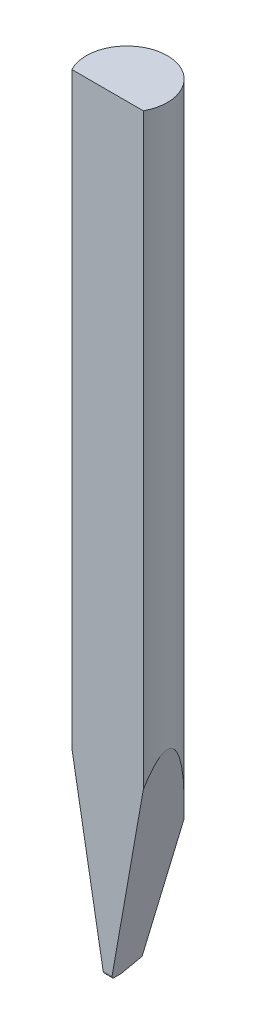
ISO-10303-21;
HEADER;
FILE_DESCRIPTION(('STEP AP214'),'2;1');
FILE_NAME('part.step','',(''),(''),'','','');
FILE_SCHEMA(('AUTOMOTIVE_DESIGN { 1 0 10303 214 1 1 1 1 }'));
ENDSEC;
DATA;
#1=APPLICATION_CONTEXT('core data for automotive mechanical design processes');
#2=APPLICATION_PROTOCOL_DEFINITION('international standard','automotive_design',2000,#1);
#3=PRODUCT_CONTEXT('',#1,'mechanical');
#4=PRODUCT('Part','Part','',(#3));
#5=PRODUCT_RELATED_PRODUCT_CATEGORY('part','',(#4));
#6=PRODUCT_DEFINITION_FORMATION('','',#4);
#7=PRODUCT_DEFINITION_CONTEXT('part definition',#1,'design');
#8=PRODUCT_DEFINITION('design','',#6,#7);
#9=PRODUCT_DEFINITION_SHAPE('','',#8);
#10=(LENGTH_UNIT() NAMED_UNIT(*) SI_UNIT(.MILLI.,.METRE.));
#11=(NAMED_UNIT(*) PLANE_ANGLE_UNIT() SI_UNIT($,.RADIAN.));
#12=(NAMED_UNIT(*) SI_UNIT($,.STERADIAN.) SOLID_ANGLE_UNIT());
#13=UNCERTAINTY_MEASURE_WITH_UNIT(LENGTH_MEASURE(1.E-05),#10,'distance_accuracy_value','');
#14=(GEOMETRIC_REPRESENTATION_CONTEXT(3) GLOBAL_UNCERTAINTY_ASSIGNED_CONTEXT((#13)) GLOBAL_UNIT_ASSIGNED_CONTEXT((#10,
#11,#12)) REPRESENTATION_CONTEXT('',''));
#15=CARTESIAN_POINT('',(0.,0.,0.));
#16=DIRECTION('',(0.,0.,1.));
#17=DIRECTION('',(1.,0.,0.));
#18=AXIS2_PLACEMENT_3D('',#15,#16,#17);
#19=CARTESIAN_POINT('',(0.,0.,0.));
#20=DIRECTION('',(0.,1.,0.));
#21=DIRECTION('',(0.,0.,1.));
#22=AXIS2_PLACEMENT_3D('',#19,#20,#21);
#23=PLANE('',#22);
#24=DIRECTION('',(0.,0.,-1.));
#25=VECTOR('',#24,1.);
#26=CARTESIAN_POINT('',(-0.0475000000000001,0.,0.10865));
#27=LINE('',#26,#25);
#28=CARTESIAN_POINT('',(-0.0475,0.,0.257439310229206));
#29=VERTEX_POINT('',#28);
#30=CARTESIAN_POINT('',(-0.0475,0.,0.1875));
#31=VERTEX_POINT('',#30);
#32=EDGE_CURVE('E312',#29,#31,#27,.T.);
#33=ORIENTED_EDGE('',*,*,#32,.F.);
#34=DIRECTION('',(-1.,0.,0.));
#35=VECTOR('',#34,1.);
#36=CARTESIAN_POINT('',(0.,0.,0.257439310229206));
#37=LINE('',#36,#35);
#38=CARTESIAN_POINT('',(-0.0255,0.,0.257439310229206));
#39=VERTEX_POINT('',#38);
#40=EDGE_CURVE('E298',#29,#39,#37,.F.);
#41=ORIENTED_EDGE('',*,*,#40,.T.);
#42=DIRECTION('',(0.,0.,-1.));
#43=VECTOR('',#42,1.);
#44=CARTESIAN_POINT('',(-0.0255,0.,-0.7935));
#45=LINE('',#44,#43);
#46=CARTESIAN_POINT('',(-0.0255,0.,0.3245));
#47=VERTEX_POINT('',#46);
#48=EDGE_CURVE('E232',#47,#39,#45,.T.);
#49=ORIENTED_EDGE('',*,*,#48,.F.);
#50=DIRECTION('',(-1.,0.,0.));
#51=VECTOR('',#50,1.);
#52=CARTESIAN_POINT('',(0.8025,0.,0.3245));
#53=LINE('',#52,#51);
#54=CARTESIAN_POINT('',(-0.0775,0.,0.3245));
#55=VERTEX_POINT('',#54);
#56=EDGE_CURVE('E394',#47,#55,#53,.T.);
#57=ORIENTED_EDGE('',*,*,#56,.T.);
#58=DIRECTION('',(0.,0.,-1.));
#59=VECTOR('',#58,1.);
#60=CARTESIAN_POINT('',(-0.0775,0.,0.8025));
#61=LINE('',#60,#59);
#62=CARTESIAN_POINT('',(-0.0775,0.,0.1875));
#63=VERTEX_POINT('',#62);
#64=EDGE_CURVE('E366',#55,#63,#61,.T.);
#65=ORIENTED_EDGE('',*,*,#64,.T.);
#66=DIRECTION('',(-1.,0.,0.));
#67=VECTOR('',#66,1.);
#68=CARTESIAN_POINT('',(0.8025,0.,0.1875));
#69=LINE('',#68,#67);
#70=EDGE_CURVE('E385',#31,#63,#69,.T.);
#71=ORIENTED_EDGE('',*,*,#70,.F.);
#72=EDGE_LOOP('',(#33,#41,#49,#57,#65,#71));
#73=FACE_BOUND('',#72,.T.);
#74=ADVANCED_FACE('F91',(#73),#23,.F.);
#75=DIRECTION('',(0.,0.,1.));
#76=VECTOR('',#75,1.);
#77=CARTESIAN_POINT('',(0.0255000000000001,0.,-0.7935));
#78=LINE('',#77,#76);
#79=CARTESIAN_POINT('',(0.0255000000000001,0.,0.257439310229206));
#80=VERTEX_POINT('',#79);
#81=CARTESIAN_POINT('',(0.0255000000000001,0.,0.3245));
#82=VERTEX_POINT('',#81);
#83=EDGE_CURVE('E237',#80,#82,#78,.T.);
#84=ORIENTED_EDGE('',*,*,#83,.F.);
#85=DIRECTION('',(-1.,0.,0.));
#86=VECTOR('',#85,1.);
#87=CARTESIAN_POINT('',(0.,0.,0.257439310229206));
#88=LINE('',#87,#86);
#89=CARTESIAN_POINT('',(0.0475,0.,0.257439310229206));
#90=VERTEX_POINT('',#89);
#91=EDGE_CURVE('E303',#80,#90,#88,.F.);
#92=ORIENTED_EDGE('',*,*,#91,.T.);
#93=DIRECTION('',(0.,0.,1.));
#94=VECTOR('',#93,1.);
#95=CARTESIAN_POINT('',(0.0475,0.,0.10865));
#96=LINE('',#95,#94);
#97=CARTESIAN_POINT('',(0.0475,0.,0.1875));
#98=VERTEX_POINT('',#97);
#99=EDGE_CURVE('E105',#98,#90,#96,.T.);
#100=ORIENTED_EDGE('',*,*,#99,.F.);
#101=CARTESIAN_POINT('',(0.0775000000000001,0.,0.1875));
#102=VERTEX_POINT('',#101);
#103=EDGE_CURVE('E382',#102,#98,#69,.T.);
#104=ORIENTED_EDGE('',*,*,#103,.F.);
#105=DIRECTION('',(0.,0.,-1.));
#106=VECTOR('',#105,1.);
#107=CARTESIAN_POINT('',(0.0775,0.,0.8025));
#108=LINE('',#107,#106);
#109=CARTESIAN_POINT('',(0.0774999999999998,0.,0.3245));
#110=VERTEX_POINT('',#109);
#111=EDGE_CURVE('E369',#110,#102,#108,.T.);
#112=ORIENTED_EDGE('',*,*,#111,.F.);
#113=EDGE_CURVE('E392',#110,#82,#53,.T.);
#114=ORIENTED_EDGE('',*,*,#113,.T.);
#115=EDGE_LOOP('',(#84,#92,#100,#104,#112,#114));
#116=FACE_BOUND('',#115,.T.);
#117=ADVANCED_FACE('F272',(#116),#23,.F.);
#118=CARTESIAN_POINT('',(0.8025,4.1116793192229,0.8025));
#119=DIRECTION('',(0.984807753012208,-0.173648177666928,0.));
#120=DIRECTION('',(0.173648177666928,0.984807753012209,0.));
#121=AXIS2_PLACEMENT_3D('',#118,#119,#120);
#122=PLANE('',#121);
#123=DIRECTION('',(0.173648177666928,0.984807753012209,0.));
#124=VECTOR('',#123,1.);
#125=CARTESIAN_POINT('',(2.61611582808828,14.397205792831,0.3755));
#126=LINE('',#125,#124);
#127=CARTESIAN_POINT('',(0.0864926760161312,0.0510000000000007,0.3755));
#128=VERTEX_POINT('',#127);
#129=CARTESIAN_POINT('',(0.697893974755478,3.51842907003117,0.3755));
#130=VERTEX_POINT('',#129);
#131=EDGE_CURVE('E348',#128,#130,#126,.T.);
#132=ORIENTED_EDGE('',*,*,#131,.F.);
#133=CARTESIAN_POINT('',(0.0864926760161314,0.051,0.3245));
#134=DIRECTION('',(0.984807753012208,-0.173648177666928,0.));
#135=DIRECTION('',(-0.173648177666928,-0.984807753012209,0.));
#136=AXIS2_PLACEMENT_3D('',#133,#134,#135);
#137=ELLIPSE('',#136,0.051786757206173,0.051);
#138=EDGE_CURVE('E386',#128,#110,#137,.T.);
#139=ORIENTED_EDGE('',*,*,#138,.T.);
#140=ORIENTED_EDGE('',*,*,#111,.T.);
#141=DIRECTION('',(0.0455893306574906,0.258549942126371,-0.964921520309633));
#142=VECTOR('',#141,1.);
#143=CARTESIAN_POINT('',(0.100417755598953,0.129973050674789,-0.29756602873305));
#144=LINE('',#143,#142);
#145=CARTESIAN_POINT('',(0.0958977476958887,0.104338812029609,-0.201897747695888));
#146=VERTEX_POINT('',#145);
#147=EDGE_CURVE('E376',#102,#146,#144,.T.);
#148=ORIENTED_EDGE('',*,*,#147,.T.);
#149=DIRECTION('',(0.171087869746033,0.970287525247816,-0.171087869746028));
#150=VECTOR('',#149,1.);
#151=CARTESIAN_POINT('',(0.752417217752885,3.82764574678896,-0.858417217752867));
#152=LINE('',#151,#150);
#153=CARTESIAN_POINT('',(0.504870168587644,2.4237366673581,-0.610870168587633));
#154=VERTEX_POINT('',#153);
#155=EDGE_CURVE('E371',#146,#154,#152,.T.);
#156=ORIENTED_EDGE('',*,*,#155,.T.);
#157=CARTESIAN_POINT('',(0.,-0.439524341020377,0.));
#158=DIRECTION('',(0.984807753012208,-0.173648177666928,0.));
#159=DIRECTION('',(-0.173648177666928,-0.984807753012209,0.));
#160=AXIS2_PLACEMENT_3D('',#157,#158,#159);
#161=ELLIPSE('',#160,4.5638256078914,0.7925);
#162=EDGE_CURVE('E363',#154,#130,#161,.T.);
#163=ORIENTED_EDGE('',*,*,#162,.T.);
#164=EDGE_LOOP('',(#132,#139,#140,#148,#156,#163));
#165=FACE_BOUND('',#164,.T.);
#166=ADVANCED_FACE('F278',(#165),#122,.T.);
#167=CARTESIAN_POINT('',(-0.0775,0.,0.8025));
#168=DIRECTION('',(-0.984807753012208,-0.173648177666928,0.));
#169=DIRECTION('',(0.173648177666928,-0.984807753012209,0.));
#170=AXIS2_PLACEMENT_3D('',#167,#168,#169);
#171=PLANE('',#170);
#172=ORIENTED_EDGE('',*,*,#64,.F.);
#173=CARTESIAN_POINT('',(-0.0864926760161316,0.051,0.3245));
#174=DIRECTION('',(-0.984807753012208,-0.173648177666928,0.));
#175=DIRECTION('',(-0.173648177666928,0.984807753012209,0.));
#176=AXIS2_PLACEMENT_3D('',#173,#174,#175);
#177=ELLIPSE('',#176,0.051786757206173,0.051);
#178=CARTESIAN_POINT('',(-0.0864926760161314,0.051,0.3755));
#179=VERTEX_POINT('',#178);
#180=EDGE_CURVE('E389',#55,#179,#177,.T.);
#181=ORIENTED_EDGE('',*,*,#180,.T.);
#182=DIRECTION('',(0.173648177666928,-0.984807753012209,0.));
#183=VECTOR('',#182,1.);
#184=CARTESIAN_POINT('',(-2.66451249990759,14.6716769578499,0.3755));
#185=LINE('',#184,#183);
#186=CARTESIAN_POINT('',(-0.697893974755478,3.51842907003117,0.3755));
#187=VERTEX_POINT('',#186);
#188=EDGE_CURVE('E345',#187,#179,#185,.T.);
#189=ORIENTED_EDGE('',*,*,#188,.F.);
#190=CARTESIAN_POINT('',(0.,-0.439524341020377,0.));
#191=DIRECTION('',(-0.984807753012208,-0.173648177666928,0.));
#192=DIRECTION('',(0.173648177666928,-0.984807753012209,0.));
#193=AXIS2_PLACEMENT_3D('',#190,#191,#192);
#194=ELLIPSE('',#193,4.5638256078914,0.7925);
#195=CARTESIAN_POINT('',(-0.504870168587645,2.4237366673581,-0.610870168587633));
#196=VERTEX_POINT('',#195);
#197=EDGE_CURVE('E360',#187,#196,#194,.T.);
#198=ORIENTED_EDGE('',*,*,#197,.T.);
#199=DIRECTION('',(0.171087869746033,-0.970287525247816,0.171087869746028));
#200=VECTOR('',#199,1.);
#201=CARTESIAN_POINT('',(-0.0486387356542045,-0.163680363775494,-0.154638735654206));
#202=LINE('',#201,#200);
#203=CARTESIAN_POINT('',(-0.0958977476958886,0.104338812029609,-0.201897747695889));
#204=VERTEX_POINT('',#203);
#205=EDGE_CURVE('E339',#196,#204,#202,.T.);
#206=ORIENTED_EDGE('',*,*,#205,.T.);
#207=DIRECTION('',(0.0455893306574906,-0.258549942126371,0.964921520309633));
#208=VECTOR('',#207,1.);
#209=CARTESIAN_POINT('',(-0.0504460723575265,-0.153430447988015,0.760110227319341));
#210=LINE('',#209,#208);
#211=EDGE_CURVE('E342',#204,#63,#210,.T.);
#212=ORIENTED_EDGE('',*,*,#211,.T.);
#213=EDGE_LOOP('',(#172,#181,#189,#198,#206,#212));
#214=FACE_BOUND('',#213,.T.);
#215=ADVANCED_FACE('F465',(#214),#171,.T.);
#216=CARTESIAN_POINT('',(-0.8025,15.,0.3755));
#217=DIRECTION('',(0.,0.,1.));
#218=DIRECTION('',(1.,0.,0.));
#219=AXIS2_PLACEMENT_3D('',#216,#217,#218);
#220=PLANE('',#219);
#221=ORIENTED_EDGE('',*,*,#188,.T.);
#222=DIRECTION('',(1.,0.,0.));
#223=VECTOR('',#222,1.);
#224=CARTESIAN_POINT('',(-0.8025,0.0510000000000007,0.3755));
#225=LINE('',#224,#223);
#226=EDGE_CURVE('E336',#179,#128,#225,.T.);
#227=ORIENTED_EDGE('',*,*,#226,.T.);
#228=ORIENTED_EDGE('',*,*,#131,.T.);
#229=DIRECTION('',(0.,-1.,0.));
#230=VECTOR('',#229,1.);
#231=CARTESIAN_POINT('',(0.697893974755478,15.,0.3755));
#232=LINE('',#231,#230);
#233=CARTESIAN_POINT('',(0.697893974755478,15.,0.3755));
#234=VERTEX_POINT('',#233);
#235=EDGE_CURVE('E356',#130,#234,#232,.F.);
#236=ORIENTED_EDGE('',*,*,#235,.T.);
#237=DIRECTION('',(-1.,0.,0.));
#238=VECTOR('',#237,1.);
#239=CARTESIAN_POINT('',(-0.8025,15.,0.3755));
#240=LINE('',#239,#238);
#241=CARTESIAN_POINT('',(-0.697893974755478,15.,0.3755));
#242=VERTEX_POINT('',#241);
#243=EDGE_CURVE('E358',#234,#242,#240,.T.);
#244=ORIENTED_EDGE('',*,*,#243,.T.);
#245=DIRECTION('',(0.,-1.,0.));
#246=VECTOR('',#245,1.);
#247=CARTESIAN_POINT('',(-0.697893974755478,15.,0.3755));
#248=LINE('',#247,#246);
#249=EDGE_CURVE('E353',#242,#187,#248,.T.);
#250=ORIENTED_EDGE('',*,*,#249,.T.);
#251=EDGE_LOOP('',(#221,#227,#228,#236,#244,#250));
#252=FACE_BOUND('',#251,.T.);
#253=ADVANCED_FACE('F286',(#252),#220,.T.);
#254=CARTESIAN_POINT('',(0.,15.,0.));
#255=DIRECTION('',(0.,-1.,0.));
#256=DIRECTION('',(0.,0.,-1.));
#257=AXIS2_PLACEMENT_3D('',#254,#255,#256);
#258=CYLINDRICAL_SURFACE('',#257,0.7925);
#259=CARTESIAN_POINT('',(0.,-1.0406802138999,0.));
#260=DIRECTION('',(0.,-0.173648177666923,-0.984807753012209));
#261=DIRECTION('',(0.,-0.984807753012209,0.173648177666923));
#262=AXIS2_PLACEMENT_3D('',#259,#260,#261);
#263=ELLIPSE('',#262,4.56382560789152,0.7925);
#264=EDGE_CURVE('E374',#196,#154,#263,.T.);
#265=ORIENTED_EDGE('',*,*,#264,.F.);
#266=ORIENTED_EDGE('',*,*,#197,.F.);
#267=ORIENTED_EDGE('',*,*,#249,.F.);
#268=CARTESIAN_POINT('',(0.,15.,0.));
#269=DIRECTION('',(0.,1.,0.));
#270=DIRECTION('',(0.,0.,1.));
#271=AXIS2_PLACEMENT_3D('',#268,#269,#270);
#272=CIRCLE('',#271,0.7925);
#273=EDGE_CURVE('E350',#234,#242,#272,.T.);
#274=ORIENTED_EDGE('',*,*,#273,.F.);
#275=ORIENTED_EDGE('',*,*,#235,.F.);
#276=ORIENTED_EDGE('',*,*,#162,.F.);
#277=EDGE_LOOP('',(#265,#266,#267,#274,#275,#276));
#278=FACE_BOUND('',#277,.T.);
#279=ADVANCED_FACE('F284',(#278),#258,.T.);
#280=CARTESIAN_POINT('',(0.,15.,0.));
#281=DIRECTION('',(0.,1.,0.));
#282=DIRECTION('',(0.,0.,1.));
#283=AXIS2_PLACEMENT_3D('',#280,#281,#282);
#284=PLANE('',#283);
#285=ORIENTED_EDGE('',*,*,#273,.T.);
#286=ORIENTED_EDGE('',*,*,#243,.F.);
#287=EDGE_LOOP('',(#285,#286));
#288=FACE_BOUND('',#287,.T.);
#289=ADVANCED_FACE('F282',(#288),#284,.T.);
#290=CARTESIAN_POINT('',(0.8025,0.104338812029609,-0.201897747695888));
#291=DIRECTION('',(0.,-0.173648177666923,-0.984807753012209));
#292=DIRECTION('',(0.,0.984807753012209,-0.173648177666923));
#293=AXIS2_PLACEMENT_3D('',#290,#291,#292);
#294=PLANE('',#293);
#295=CARTESIAN_POINT('',(0.,0.603593196235099,-0.289929765868303));
#296=DIRECTION('',(0.,-0.173648177666923,-0.984807753012209));
#297=DIRECTION('',(0.,0.984807753012209,-0.173648177666923));
#298=AXIS2_PLACEMENT_3D('',#295,#296,#297);
#299=ELLIPSE('',#298,0.25750528005028,0.119084095903733);
#300=CARTESIAN_POINT('',(0.,0.857186392470194,-0.334645088488644));
#301=VERTEX_POINT('',#300);
#302=EDGE_CURVE('E324',#301,#301,#299,.T.);
#303=ORIENTED_EDGE('',*,*,#302,.F.);
#304=EDGE_LOOP('',(#303));
#305=FACE_BOUND('',#304,.T.);
#306=DIRECTION('',(-1.,0.,0.));
#307=VECTOR('',#306,1.);
#308=CARTESIAN_POINT('',(0.8025,0.104338812029609,-0.201897747695888));
#309=LINE('',#308,#307);
#310=EDGE_CURVE('E379',#146,#204,#309,.T.);
#311=ORIENTED_EDGE('',*,*,#310,.T.);
#312=ORIENTED_EDGE('',*,*,#205,.F.);
#313=ORIENTED_EDGE('',*,*,#264,.T.);
#314=ORIENTED_EDGE('',*,*,#155,.F.);
#315=EDGE_LOOP('',(#311,#312,#313,#314));
#316=FACE_BOUND('',#315,.T.);
#317=ADVANCED_FACE('F458',(#305,#316),#294,.T.);
#318=CARTESIAN_POINT('',(0.8025,0.,0.1875));
#319=DIRECTION('',(0.,-0.96592582628907,-0.258819045102515));
#320=DIRECTION('',(0.,0.258819045102515,-0.96592582628907));
#321=AXIS2_PLACEMENT_3D('',#318,#319,#320);
#322=PLANE('',#321);
#323=DIRECTION('',(0.,0.258819045102515,-0.96592582628907));
#324=VECTOR('',#323,1.);
#325=CARTESIAN_POINT('',(-0.0474999999999999,0.,0.1875));
#326=LINE('',#325,#324);
#327=CARTESIAN_POINT('',(-0.0475000000000001,0.0551171488830805,-0.0182));
#328=VERTEX_POINT('',#327);
#329=EDGE_CURVE('E329',#31,#328,#326,.T.);
#330=ORIENTED_EDGE('',*,*,#329,.F.);
#331=ORIENTED_EDGE('',*,*,#70,.T.);
#332=ORIENTED_EDGE('',*,*,#211,.F.);
#333=ORIENTED_EDGE('',*,*,#310,.F.);
#334=ORIENTED_EDGE('',*,*,#147,.F.);
#335=ORIENTED_EDGE('',*,*,#103,.T.);
#336=DIRECTION('',(0.,-0.258819045102515,0.96592582628907));
#337=VECTOR('',#336,1.);
#338=CARTESIAN_POINT('',(0.0474999999999999,0.,0.1875));
#339=LINE('',#338,#337);
#340=CARTESIAN_POINT('',(0.0475,0.0551171488830805,-0.0182));
#341=VERTEX_POINT('',#340);
#342=EDGE_CURVE('E334',#341,#98,#339,.T.);
#343=ORIENTED_EDGE('',*,*,#342,.F.);
#344=DIRECTION('',(1.,0.,0.));
#345=VECTOR('',#344,1.);
#346=CARTESIAN_POINT('',(0.8025,0.0551171488830805,-0.0182));
#347=LINE('',#346,#345);
#348=EDGE_CURVE('E331',#328,#341,#347,.T.);
#349=ORIENTED_EDGE('',*,*,#348,.F.);
#350=EDGE_LOOP('',(#330,#331,#332,#333,#334,#335,#343,#349));
#351=FACE_BOUND('',#350,.T.);
#352=ADVANCED_FACE('F455',(#351),#322,.T.);
#353=CARTESIAN_POINT('',(0.8025,0.051,0.3245));
#354=DIRECTION('',(-1.,0.,0.));
#355=DIRECTION('',(0.,0.,1.));
#356=AXIS2_PLACEMENT_3D('',#353,#354,#355);
#357=CYLINDRICAL_SURFACE('',#356,0.051);
#358=CARTESIAN_POINT('',(-0.00171830943409526,0.051,0.3245));
#359=DIRECTION('',(-0.906307787036651,0.422618261740697,0.));
#360=DIRECTION('',(-0.422618261740697,-0.906307787036651,0.));
#361=AXIS2_PLACEMENT_3D('',#358,#359,#360);
#362=ELLIPSE('',#361,0.056272273867087,0.051);
#363=CARTESIAN_POINT('',(-0.0143852986017202,0.0238355540680084,0.367663559598438));
#364=VERTEX_POINT('',#363);
#365=EDGE_CURVE('E244',#47,#364,#362,.T.);
#366=ORIENTED_EDGE('',*,*,#365,.T.);
#367=CARTESIAN_POINT('',(-0.0143852986017201,0.0238355540680084,0.367663559598438));
#368=CARTESIAN_POINT('',(-0.0140488024893387,0.0245599728875085,0.368120330125));
#369=CARTESIAN_POINT('',(-0.0136469823715301,0.0252761590346725,0.368544702556877));
#370=CARTESIAN_POINT('',(-0.0127157760141209,0.0266634537717098,0.369325752032183));
#371=CARTESIAN_POINT('',(-0.0121861099480505,0.0273344592929303,0.369682277469204));
#372=CARTESIAN_POINT('',(-0.0110017272996389,0.0286015476427805,0.370323813508433));
#373=CARTESIAN_POINT('',(-0.0103465755008802,0.0291973573780401,0.370608566983727));
#374=CARTESIAN_POINT('',(-0.00892931897366891,0.0302803081885538,0.371105246034449));
#375=CARTESIAN_POINT('',(-0.00816738633120438,0.0307676209074657,0.371317286933398));
#376=CARTESIAN_POINT('',(-0.00661142196689859,0.0315824690415379,0.371660824038474));
#377=CARTESIAN_POINT('',(-0.00582269948958903,0.0319183337598971,0.371796661246428));
#378=CARTESIAN_POINT('',(-0.00419400373586091,0.0324599158631989,0.372011586808007));
#379=CARTESIAN_POINT('',(-0.00335401105521102,0.0326655836334157,0.372090653529391));
#380=CARTESIAN_POINT('',(-0.00167394162120721,0.0329337176823904,0.37219307618541));
#381=CARTESIAN_POINT('',(-0.000834607436282753,0.0330002533270435,0.372218016090317));
#382=CARTESIAN_POINT('',(0.000843851956455435,0.0329997453285332,0.372217825731411));
#383=CARTESIAN_POINT('',(0.00168297716720856,0.0329327329412131,0.372192707183377));
#384=CARTESIAN_POINT('',(0.00333320676255795,0.0326684440640425,0.372091739020442));
#385=CARTESIAN_POINT('',(0.00414442475834964,0.0324717842215133,0.372016129535638));
#386=CARTESIAN_POINT('',(0.00572009442136969,0.0319566442994558,0.371812015118309));
#387=CARTESIAN_POINT('',(0.00648454891433118,0.0316381715890471,0.371683513385488));
#388=CARTESIAN_POINT('',(0.00794846664448581,0.0308910568930543,0.37136997241993));
#389=CARTESIAN_POINT('',(0.0086476870228246,0.0304620239820663,0.371184732120017));
#390=CARTESIAN_POINT('',(0.0099604933900658,0.029512204985364,0.370755219298662));
#391=CARTESIAN_POINT('',(0.0105740571866019,0.0289913952003807,0.370510931523496));
#392=CARTESIAN_POINT('',(0.0117160814376734,0.0278665298179182,0.369955965582428));
#393=CARTESIAN_POINT('',(0.0122421796402759,0.0272607934847157,0.369643850856636));
#394=CARTESIAN_POINT('',(0.0131836945923898,0.02600120294203,0.368958643617409));
#395=CARTESIAN_POINT('',(0.0135992226344418,0.025347397967944,0.368585613032941));
#396=CARTESIAN_POINT('',(0.0141112867742827,0.0244013659626461,0.368015773871397));
#397=CARTESIAN_POINT('',(0.0142531744217309,0.0241190717637415,0.367842055288229));
#398=CARTESIAN_POINT('',(0.0143852986017204,0.0238355540680085,0.367663559598438));
#399=B_SPLINE_CURVE_WITH_KNOTS('',3,(#367,#368,#369,#370,#371,#372,#373,#374,#375,#376,#377,
#378,#379,#380,#381,#382,#383,#384,#385,#386,#387,#388,#389,#390,#391,#392,#393,#394,#395,#396,
#397,#398),.UNSPECIFIED.,.F.,.F.,(4,2,2,2,2,2,2,2,2,2,2,2,2,2,2,4),(0.,0.00275970931888948,
0.00552551469658797,0.00830109221832556,0.0110722470378698,0.0136631999167849,
0.0162551395481397,0.0187701441019566,0.0212845601083016,0.0237871021579743,0.026289492839271,
0.0288008560207815,0.0313128686569765,0.0338844307334143,0.036453394571599,0.0375342516796701),.UNSPECIFIED.);
#400=CARTESIAN_POINT('',(0.0143852986017204,0.0238355540680084,0.367663559598438));
#401=VERTEX_POINT('',#400);
#402=EDGE_CURVE('E226',#364,#401,#399,.T.);
#403=ORIENTED_EDGE('',*,*,#402,.T.);
#404=CARTESIAN_POINT('',(0.00171830943409537,0.051,0.3245));
#405=DIRECTION('',(0.906307787036652,0.422618261740695,0.));
#406=DIRECTION('',(-0.422618261740695,0.906307787036652,0.));
#407=AXIS2_PLACEMENT_3D('',#404,#405,#406);
#408=ELLIPSE('',#407,0.056272273867087,0.051);
#409=EDGE_CURVE('E235',#401,#82,#408,.T.);
#410=ORIENTED_EDGE('',*,*,#409,.T.);
#411=ORIENTED_EDGE('',*,*,#113,.F.);
#412=ORIENTED_EDGE('',*,*,#138,.F.);
#413=ORIENTED_EDGE('',*,*,#226,.F.);
#414=ORIENTED_EDGE('',*,*,#180,.F.);
#415=ORIENTED_EDGE('',*,*,#56,.F.);
#416=EDGE_LOOP('',(#366,#403,#410,#411,#412,#413,#414,#415));
#417=FACE_BOUND('',#416,.T.);
#418=ADVANCED_FACE('F242',(#417),#357,.T.);
#419=CARTESIAN_POINT('',(-0.0475,0.2083,0.115237938927801));
#420=DIRECTION('',(-1.,0.,0.));
#421=DIRECTION('',(0.,0.,-1.));
#422=AXIS2_PLACEMENT_3D('',#419,#420,#421);
#423=PLANE('',#422);
#424=ORIENTED_EDGE('',*,*,#329,.T.);
#425=DIRECTION('',(0.,-1.,0.));
#426=VECTOR('',#425,1.);
#427=CARTESIAN_POINT('',(-0.0475,0.10415,-0.0182));
#428=LINE('',#427,#426);
#429=CARTESIAN_POINT('',(-0.0474999999999999,0.2083,-0.0181999999999999));
#430=VERTEX_POINT('',#429);
#431=EDGE_CURVE('E412',#430,#328,#428,.T.);
#432=ORIENTED_EDGE('',*,*,#431,.F.);
#433=DIRECTION('',(0.,0.,-1.));
#434=VECTOR('',#433,1.);
#435=CARTESIAN_POINT('',(-0.0474999999999999,0.2083,0.0485189694639005));
#436=LINE('',#435,#434);
#437=CARTESIAN_POINT('',(-0.0475,0.2083,0.115237938927801));
#438=VERTEX_POINT('',#437);
#439=EDGE_CURVE('E415',#438,#430,#436,.T.);
#440=ORIENTED_EDGE('',*,*,#439,.F.);
#441=DIRECTION('',(0.,-0.866025403784438,0.5));
#442=VECTOR('',#441,1.);
#443=CARTESIAN_POINT('',(-0.0475,0.10415,0.1753689694639));
#444=LINE('',#443,#442);
#445=CARTESIAN_POINT('',(-0.0475,0.019,0.224530344885397));
#446=VERTEX_POINT('',#445);
#447=EDGE_CURVE('E316',#438,#446,#444,.T.);
#448=ORIENTED_EDGE('',*,*,#447,.T.);
#449=CARTESIAN_POINT('',(-0.0475,0.038,0.257439310229206));
#450=DIRECTION('',(-1.,0.,0.));
#451=DIRECTION('',(0.,-1.,0.));
#452=AXIS2_PLACEMENT_3D('',#449,#450,#451);
#453=CIRCLE('',#452,0.038);
#454=EDGE_CURVE('E99',#446,#29,#453,.T.);
#455=ORIENTED_EDGE('',*,*,#454,.T.);
#456=ORIENTED_EDGE('',*,*,#32,.T.);
#457=EDGE_LOOP('',(#424,#432,#440,#448,#455,#456));
#458=FACE_BOUND('',#457,.T.);
#459=ADVANCED_FACE('F311',(#458),#423,.F.);
#460=CARTESIAN_POINT('',(-0.0474999999999999,0.2083,-0.0181999999999999));
#461=DIRECTION('',(0.,0.,-1.));
#462=DIRECTION('',(1.,0.,0.));
#463=AXIS2_PLACEMENT_3D('',#460,#461,#462);
#464=PLANE('',#463);
#465=DIRECTION('',(1.,0.,0.));
#466=VECTOR('',#465,1.);
#467=CARTESIAN_POINT('',(0.,0.2083,-0.0181999999999999));
#468=LINE('',#467,#466);
#469=CARTESIAN_POINT('',(0.0444999999999998,0.2083,-0.0181999999999999));
#470=VERTEX_POINT('',#469);
#471=CARTESIAN_POINT('',(0.0475000000000001,0.2083,-0.0181999999999999));
#472=VERTEX_POINT('',#471);
#473=EDGE_CURVE('E408',#470,#472,#468,.T.);
#474=ORIENTED_EDGE('',*,*,#473,.F.);
#475=CARTESIAN_POINT('',(0.,0.208299996085444,-0.0181999999999999));
#476=DIRECTION('',(0.,0.,-1.));
#477=DIRECTION('',(0.,1.,0.));
#478=AXIS2_PLACEMENT_3D('',#475,#476,#477);
#479=ELLIPSE('',#478,0.0629325035256026,0.0444999999999999);
#480=CARTESIAN_POINT('',(-0.0444999999999998,0.2083,-0.0181999999999999));
#481=VERTEX_POINT('',#480);
#482=EDGE_CURVE('E327',#470,#481,#479,.T.);
#483=ORIENTED_EDGE('',*,*,#482,.T.);
#484=EDGE_CURVE('E409',#430,#481,#468,.T.);
#485=ORIENTED_EDGE('',*,*,#484,.F.);
#486=ORIENTED_EDGE('',*,*,#431,.T.);
#487=ORIENTED_EDGE('',*,*,#348,.T.);
#488=DIRECTION('',(0.,-1.,0.));
#489=VECTOR('',#488,1.);
#490=CARTESIAN_POINT('',(0.0475,0.10415,-0.0182));
#491=LINE('',#490,#489);
#492=EDGE_CURVE('E406',#472,#341,#491,.T.);
#493=ORIENTED_EDGE('',*,*,#492,.F.);
#494=EDGE_LOOP('',(#474,#483,#485,#486,#487,#493));
#495=FACE_BOUND('',#494,.T.);
#496=ADVANCED_FACE('F444',(#495),#464,.F.);
#497=CARTESIAN_POINT('',(0.0475000000000001,0.2083,-0.0181999999999999));
#498=DIRECTION('',(1.,0.,0.));
#499=DIRECTION('',(0.,0.,1.));
#500=AXIS2_PLACEMENT_3D('',#497,#498,#499);
#501=PLANE('',#500);
#502=ORIENTED_EDGE('',*,*,#342,.T.);
#503=ORIENTED_EDGE('',*,*,#99,.T.);
#504=CARTESIAN_POINT('',(0.0474999999999999,0.038,0.257439310229206));
#505=DIRECTION('',(1.,0.,0.));
#506=DIRECTION('',(0.,1.,0.));
#507=AXIS2_PLACEMENT_3D('',#504,#505,#506);
#508=CIRCLE('',#507,0.038);
#509=CARTESIAN_POINT('',(0.0475,0.019,0.224530344885397));
#510=VERTEX_POINT('',#509);
#511=EDGE_CURVE('E12',#90,#510,#508,.T.);
#512=ORIENTED_EDGE('',*,*,#511,.T.);
#513=DIRECTION('',(0.,-0.866025403784438,0.5));
#514=VECTOR('',#513,1.);
#515=CARTESIAN_POINT('',(0.0475,0.10415,0.1753689694639));
#516=LINE('',#515,#514);
#517=CARTESIAN_POINT('',(0.0475,0.2083,0.115237938927801));
#518=VERTEX_POINT('',#517);
#519=EDGE_CURVE('E400',#518,#510,#516,.T.);
#520=ORIENTED_EDGE('',*,*,#519,.F.);
#521=DIRECTION('',(0.,0.,1.));
#522=VECTOR('',#521,1.);
#523=CARTESIAN_POINT('',(0.0475,0.2083,0.0485189694639005));
#524=LINE('',#523,#522);
#525=EDGE_CURVE('E403',#472,#518,#524,.T.);
#526=ORIENTED_EDGE('',*,*,#525,.F.);
#527=ORIENTED_EDGE('',*,*,#492,.T.);
#528=EDGE_LOOP('',(#502,#503,#512,#520,#526,#527));
#529=FACE_BOUND('',#528,.T.);
#530=ADVANCED_FACE('F447',(#529),#501,.F.);
#531=CARTESIAN_POINT('',(0.0475,0.2083,0.115237938927801));
#532=DIRECTION('',(0.,0.5,0.866025403784438));
#533=DIRECTION('',(-1.,0.,0.));
#534=AXIS2_PLACEMENT_3D('',#531,#532,#533);
#535=PLANE('',#534);
#536=DIRECTION('',(0.374453581814995,0.803018297611854,-0.4636228302904));
#537=VECTOR('',#536,1.);
#538=CARTESIAN_POINT('',(0.149059569840535,0.374344205564202,0.0193722721479315));
#539=LINE('',#538,#537);
#540=CARTESIAN_POINT('',(-0.0166401544950551,0.019,0.224530344885397));
#541=VERTEX_POINT('',#540);
#542=CARTESIAN_POINT('',(-0.0143852986017202,0.0238355540680084,0.221738536442551));
#543=VERTEX_POINT('',#542);
#544=EDGE_CURVE('E245',#541,#543,#539,.T.);
#545=ORIENTED_EDGE('',*,*,#544,.F.);
#546=DIRECTION('',(-1.,0.,0.));
#547=VECTOR('',#546,1.);
#548=CARTESIAN_POINT('',(0.0475,0.0189999999999999,0.224530344885397));
#549=LINE('',#548,#547);
#550=EDGE_CURVE('E300',#541,#446,#549,.T.);
#551=ORIENTED_EDGE('',*,*,#550,.T.);
#552=ORIENTED_EDGE('',*,*,#447,.F.);
#553=DIRECTION('',(-1.,0.,0.));
#554=VECTOR('',#553,1.);
#555=CARTESIAN_POINT('',(0.,0.2083,0.115237938927801));
#556=LINE('',#555,#554);
#557=EDGE_CURVE('E398',#518,#438,#556,.T.);
#558=ORIENTED_EDGE('',*,*,#557,.F.);
#559=ORIENTED_EDGE('',*,*,#519,.T.);
#560=DIRECTION('',(-1.,0.,0.));
#561=VECTOR('',#560,1.);
#562=CARTESIAN_POINT('',(0.0475,0.0189999999999999,0.224530344885397));
#563=LINE('',#562,#561);
#564=CARTESIAN_POINT('',(0.0166401544950552,0.0189999999999999,0.224530344885397));
#565=VERTEX_POINT('',#564);
#566=EDGE_CURVE('E319',#510,#565,#563,.T.);
#567=ORIENTED_EDGE('',*,*,#566,.T.);
#568=DIRECTION('',(0.374453581814993,-0.803018297611855,0.4636228302904));
#569=VECTOR('',#568,1.);
#570=CARTESIAN_POINT('',(-0.161865420426759,0.401806440769372,0.00351694325967725));
#571=LINE('',#570,#569);
#572=CARTESIAN_POINT('',(0.0143852986017204,0.0238355540680083,0.221738536442552));
#573=VERTEX_POINT('',#572);
#574=EDGE_CURVE('E645',#573,#565,#571,.T.);
#575=ORIENTED_EDGE('',*,*,#574,.F.);
#576=CARTESIAN_POINT('',(0.,0.0171275791651799,0.225611387558417));
#577=DIRECTION('',(0.,0.5,0.866025403784438));
#578=DIRECTION('',(0.,-0.866025403784438,0.5));
#579=AXIS2_PLACEMENT_3D('',#576,#577,#578);
#580=ELLIPSE('',#579,0.0183278928833489,0.0158724208348201);
#581=EDGE_CURVE('E229',#543,#573,#580,.F.);
#582=ORIENTED_EDGE('',*,*,#581,.F.);
#583=EDGE_LOOP('',(#545,#551,#552,#558,#559,#567,#575,#582));
#584=FACE_BOUND('',#583,.T.);
#585=ADVANCED_FACE('F318',(#584),#535,.F.);
#586=CARTESIAN_POINT('',(0.,0.2083,0.));
#587=DIRECTION('',(0.,-1.,0.));
#588=DIRECTION('',(0.,0.,-1.));
#589=AXIS2_PLACEMENT_3D('',#586,#587,#588);
#590=PLANE('',#589);
#591=CARTESIAN_POINT('',(0.,0.2083,-0.0182000039145562));
#592=DIRECTION('',(0.,-1.,0.));
#593=DIRECTION('',(0.,0.,-1.));
#594=AXIS2_PLACEMENT_3D('',#591,#592,#593);
#595=ELLIPSE('',#594,0.0629325035256026,0.0444999999999999);
#596=EDGE_CURVE('E321',#470,#481,#595,.T.);
#597=ORIENTED_EDGE('',*,*,#596,.F.);
#598=ORIENTED_EDGE('',*,*,#473,.T.);
#599=ORIENTED_EDGE('',*,*,#525,.T.);
#600=ORIENTED_EDGE('',*,*,#557,.T.);
#601=ORIENTED_EDGE('',*,*,#439,.T.);
#602=ORIENTED_EDGE('',*,*,#484,.T.);
#603=EDGE_LOOP('',(#597,#598,#599,#600,#601,#602));
#604=FACE_BOUND('',#603,.T.);
#605=ADVANCED_FACE('F436',(#604),#590,.T.);
#606=CARTESIAN_POINT('',(0.,0.162691608698909,0.0274083873865352));
#607=DIRECTION('',(0.,0.707106781186548,-0.707106781186547));
#608=DIRECTION('',(0.,0.707106781186547,0.707106781186548));
#609=AXIS2_PLACEMENT_3D('',#606,#607,#608);
#610=CYLINDRICAL_SURFACE('',#609,0.0444999999999999);
#611=CARTESIAN_POINT('',(0.,0.36563983317703,-0.175539837091587));
#612=DIRECTION('',(0.,-0.707106781186548,0.707106781186547));
#613=DIRECTION('',(0.,-0.707106781186547,-0.707106781186548));
#614=AXIS2_PLACEMENT_3D('',#611,#612,#613);
#615=CIRCLE('',#614,0.0445000000000014);
#616=CARTESIAN_POINT('',(0.,0.334173581414228,-0.207006088854389));
#617=VERTEX_POINT('',#616);
#618=EDGE_CURVE('E240',#617,#617,#615,.T.);
#619=ORIENTED_EDGE('',*,*,#618,.F.);
#620=EDGE_LOOP('',(#619));
#621=FACE_BOUND('',#620,.T.);
#622=ORIENTED_EDGE('',*,*,#596,.T.);
#623=ORIENTED_EDGE('',*,*,#482,.F.);
#624=EDGE_LOOP('',(#622,#623));
#625=FACE_BOUND('',#624,.T.);
#626=ADVANCED_FACE('F426',(#621,#625),#610,.F.);
#627=CARTESIAN_POINT('',(0.,0.36563983317703,-0.175539837091587));
#628=DIRECTION('',(0.,0.707106781186548,-0.707106781186547));
#629=DIRECTION('',(0.,0.707106781186547,0.707106781186548));
#630=AXIS2_PLACEMENT_3D('',#627,#628,#629);
#631=CONICAL_SURFACE('',#630,0.0445000000000014,0.392699081698724);
#632=ORIENTED_EDGE('',*,*,#302,.T.);
#633=EDGE_LOOP('',(#632));
#634=FACE_BOUND('',#633,.T.);
#635=ORIENTED_EDGE('',*,*,#618,.T.);
#636=EDGE_LOOP('',(#635));
#637=FACE_BOUND('',#636,.T.);
#638=ADVANCED_FACE('F269',(#634,#637),#631,.F.);
#639=CARTESIAN_POINT('',(0.,0.0171275791651799,-0.7935));
#640=DIRECTION('',(0.,0.,1.));
#641=DIRECTION('',(1.,0.,0.));
#642=AXIS2_PLACEMENT_3D('',#639,#640,#641);
#643=CYLINDRICAL_SURFACE('',#642,0.0158724208348201);
#644=DIRECTION('',(0.,0.,1.));
#645=VECTOR('',#644,1.);
#646=CARTESIAN_POINT('',(-0.0143852986017202,0.0238355540680084,-0.7935));
#647=LINE('',#646,#645);
#648=EDGE_CURVE('E231',#543,#364,#647,.T.);
#649=ORIENTED_EDGE('',*,*,#648,.F.);
#650=ORIENTED_EDGE('',*,*,#581,.T.);
#651=DIRECTION('',(0.,0.,1.));
#652=VECTOR('',#651,1.);
#653=CARTESIAN_POINT('',(0.0143852986017204,0.0238355540680084,-0.7935));
#654=LINE('',#653,#652);
#655=EDGE_CURVE('E221',#573,#401,#654,.T.);
#656=ORIENTED_EDGE('',*,*,#655,.T.);
#657=ORIENTED_EDGE('',*,*,#402,.F.);
#658=EDGE_LOOP('',(#649,#650,#656,#657));
#659=FACE_BOUND('',#658,.T.);
#660=ADVANCED_FACE('F224',(#659),#643,.F.);
#661=CARTESIAN_POINT('',(-0.0306973646337027,-0.0111457844253872,-0.7935));
#662=DIRECTION('',(-0.906307787036651,0.422618261740697,0.));
#663=DIRECTION('',(-0.422618261740697,-0.906307787036651,0.));
#664=AXIS2_PLACEMENT_3D('',#661,#662,#663);
#665=PLANE('',#664);
#666=ORIENTED_EDGE('',*,*,#48,.T.);
#667=CARTESIAN_POINT('',(-0.00778030899011014,0.038,0.257439310229206));
#668=DIRECTION('',(-0.906307787036651,0.422618261740697,0.));
#669=DIRECTION('',(-0.422618261740697,-0.906307787036651,0.));
#670=AXIS2_PLACEMENT_3D('',#667,#668,#669);
#671=ELLIPSE('',#670,0.0419283609205746,0.038);
#672=EDGE_CURVE('E297',#39,#541,#671,.F.);
#673=ORIENTED_EDGE('',*,*,#672,.T.);
#674=ORIENTED_EDGE('',*,*,#544,.T.);
#675=ORIENTED_EDGE('',*,*,#648,.T.);
#676=ORIENTED_EDGE('',*,*,#365,.F.);
#677=EDGE_LOOP('',(#666,#673,#674,#675,#676));
#678=FACE_BOUND('',#677,.T.);
#679=ADVANCED_FACE('F261',(#678),#665,.F.);
#680=CARTESIAN_POINT('',(0.0143852986017204,0.0238355540680083,-0.7935));
#681=DIRECTION('',(0.906307787036652,0.422618261740695,0.));
#682=DIRECTION('',(-0.422618261740695,0.906307787036652,0.));
#683=AXIS2_PLACEMENT_3D('',#680,#681,#682);
#684=PLANE('',#683);
#685=ORIENTED_EDGE('',*,*,#574,.T.);
#686=CARTESIAN_POINT('',(0.00778030899011034,0.038,0.257439310229206));
#687=DIRECTION('',(0.906307787036652,0.422618261740695,0.));
#688=DIRECTION('',(-0.422618261740695,0.906307787036652,0.));
#689=AXIS2_PLACEMENT_3D('',#686,#687,#688);
#690=ELLIPSE('',#689,0.0419283609205746,0.038);
#691=EDGE_CURVE('E113',#565,#80,#690,.F.);
#692=ORIENTED_EDGE('',*,*,#691,.T.);
#693=ORIENTED_EDGE('',*,*,#83,.T.);
#694=ORIENTED_EDGE('',*,*,#409,.F.);
#695=ORIENTED_EDGE('',*,*,#655,.F.);
#696=EDGE_LOOP('',(#685,#692,#693,#694,#695));
#697=FACE_BOUND('',#696,.T.);
#698=ADVANCED_FACE('F236',(#697),#684,.F.);
#699=CARTESIAN_POINT('',(0.0475,0.038,0.257439310229206));
#700=DIRECTION('',(-1.,0.,0.));
#701=DIRECTION('',(0.,0.,1.));
#702=AXIS2_PLACEMENT_3D('',#699,#700,#701);
#703=CYLINDRICAL_SURFACE('',#702,0.038);
#704=ORIENTED_EDGE('',*,*,#672,.F.);
#705=ORIENTED_EDGE('',*,*,#40,.F.);
#706=ORIENTED_EDGE('',*,*,#454,.F.);
#707=ORIENTED_EDGE('',*,*,#550,.F.);
#708=EDGE_LOOP('',(#704,#705,#706,#707));
#709=FACE_BOUND('',#708,.T.);
#710=ADVANCED_FACE('F268',(#709),#703,.T.);
#711=CARTESIAN_POINT('',(0.0475,0.038,0.257439310229206));
#712=DIRECTION('',(-1.,0.,0.));
#713=DIRECTION('',(0.,0.,1.));
#714=AXIS2_PLACEMENT_3D('',#711,#712,#713);
#715=CYLINDRICAL_SURFACE('',#714,0.038);
#716=ORIENTED_EDGE('',*,*,#511,.F.);
#717=ORIENTED_EDGE('',*,*,#91,.F.);
#718=ORIENTED_EDGE('',*,*,#691,.F.);
#719=ORIENTED_EDGE('',*,*,#566,.F.);
#720=EDGE_LOOP('',(#716,#717,#718,#719));
#721=FACE_BOUND('',#720,.T.);
#722=ADVANCED_FACE('F93',(#721),#715,.T.);
#723=CLOSED_SHELL('',(#74,#117,#166,#215,#253,#279,#289,#317,#352,#418,#459,#496,#530,#585,#605,
#626,#638,#660,#679,#698,#710,#722));
#724=MANIFOLD_SOLID_BREP('B2',#723);
#725=ADVANCED_BREP_SHAPE_REPRESENTATION('',(#18,#724),#14);
#726=SHAPE_DEFINITION_REPRESENTATION(#9,#725);
ENDSEC;
END-ISO-10303-21;
